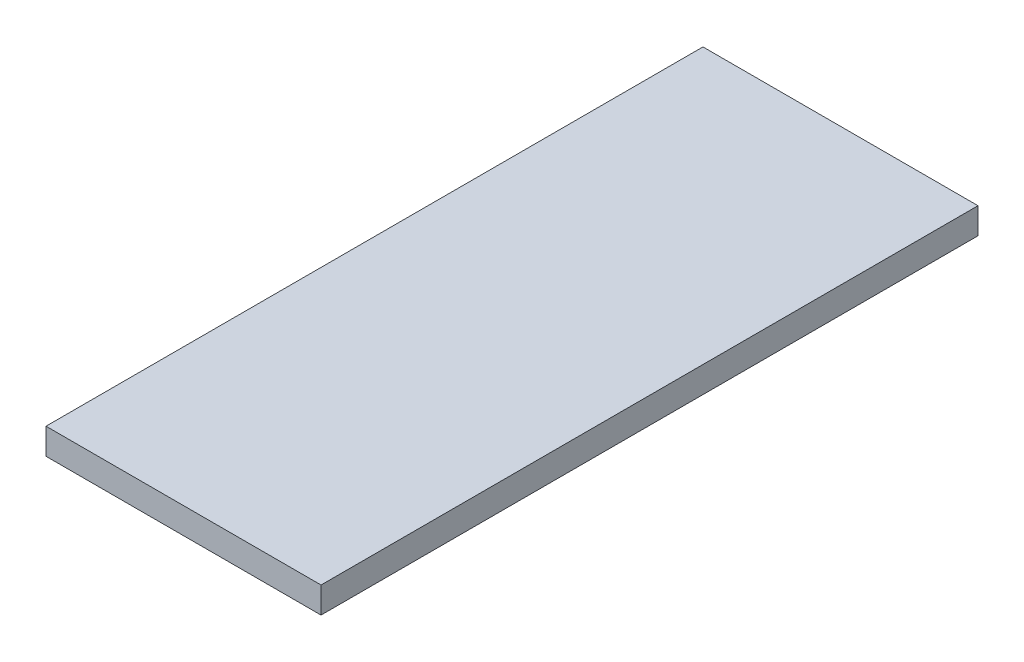
ISO-10303-21;
HEADER;
FILE_DESCRIPTION(('STEP AP214'),'2;1');
FILE_NAME('part.step','',(''),(''),'','','');
FILE_SCHEMA(('AUTOMOTIVE_DESIGN { 1 0 10303 214 1 1 1 1 }'));
ENDSEC;
DATA;
#1=APPLICATION_CONTEXT('core data for automotive mechanical design processes');
#2=APPLICATION_PROTOCOL_DEFINITION('international standard','automotive_design',2000,#1);
#3=PRODUCT_CONTEXT('',#1,'mechanical');
#4=PRODUCT('Part','Part','',(#3));
#5=PRODUCT_RELATED_PRODUCT_CATEGORY('part','',(#4));
#6=PRODUCT_DEFINITION_FORMATION('','',#4);
#7=PRODUCT_DEFINITION_CONTEXT('part definition',#1,'design');
#8=PRODUCT_DEFINITION('design','',#6,#7);
#9=PRODUCT_DEFINITION_SHAPE('','',#8);
#10=(LENGTH_UNIT() NAMED_UNIT(*) SI_UNIT(.MILLI.,.METRE.));
#11=(NAMED_UNIT(*) PLANE_ANGLE_UNIT() SI_UNIT($,.RADIAN.));
#12=(NAMED_UNIT(*) SI_UNIT($,.STERADIAN.) SOLID_ANGLE_UNIT());
#13=UNCERTAINTY_MEASURE_WITH_UNIT(LENGTH_MEASURE(1.E-05),#10,'distance_accuracy_value','');
#14=(GEOMETRIC_REPRESENTATION_CONTEXT(3) GLOBAL_UNCERTAINTY_ASSIGNED_CONTEXT((#13)) GLOBAL_UNIT_ASSIGNED_CONTEXT((#10,
#11,#12)) REPRESENTATION_CONTEXT('',''));
#15=CARTESIAN_POINT('',(0.,0.,0.));
#16=DIRECTION('',(0.,0.,1.));
#17=DIRECTION('',(1.,0.,0.));
#18=AXIS2_PLACEMENT_3D('',#15,#16,#17);
#19=CARTESIAN_POINT('',(0.,4.7625,0.));
#20=DIRECTION('',(1.,0.,0.));
#21=DIRECTION('',(0.,0.,-1.));
#22=AXIS2_PLACEMENT_3D('',#19,#20,#21);
#23=PLANE('',#22);
#24=DIRECTION('',(0.,0.,1.));
#25=VECTOR('',#24,1.);
#26=CARTESIAN_POINT('',(0.,0.,0.));
#27=LINE('',#26,#25);
#28=CARTESIAN_POINT('',(0.,0.,-120.));
#29=VERTEX_POINT('',#28);
#30=CARTESIAN_POINT('',(0.,0.,0.));
#31=VERTEX_POINT('',#30);
#32=EDGE_CURVE('E95',#29,#31,#27,.T.);
#33=ORIENTED_EDGE('',*,*,#32,.T.);
#34=DIRECTION('',(0.,-1.,0.));
#35=VECTOR('',#34,1.);
#36=CARTESIAN_POINT('',(0.,4.7625,0.));
#37=LINE('',#36,#35);
#38=CARTESIAN_POINT('',(0.,4.7625,0.));
#39=VERTEX_POINT('',#38);
#40=EDGE_CURVE('E11',#39,#31,#37,.T.);
#41=ORIENTED_EDGE('',*,*,#40,.F.);
#42=DIRECTION('',(0.,0.,1.));
#43=VECTOR('',#42,1.);
#44=CARTESIAN_POINT('',(0.,4.7625,0.));
#45=LINE('',#44,#43);
#46=CARTESIAN_POINT('',(0.,4.7625,-120.));
#47=VERTEX_POINT('',#46);
#48=EDGE_CURVE('E83',#47,#39,#45,.T.);
#49=ORIENTED_EDGE('',*,*,#48,.F.);
#50=DIRECTION('',(0.,-1.,0.));
#51=VECTOR('',#50,1.);
#52=CARTESIAN_POINT('',(0.,4.7625,-120.));
#53=LINE('',#52,#51);
#54=EDGE_CURVE('E91',#47,#29,#53,.T.);
#55=ORIENTED_EDGE('',*,*,#54,.T.);
#56=EDGE_LOOP('',(#33,#41,#49,#55));
#57=FACE_BOUND('',#56,.T.);
#58=ADVANCED_FACE('F32',(#57),#23,.F.);
#59=CARTESIAN_POINT('',(0.,4.7625,0.));
#60=DIRECTION('',(0.,0.,-1.));
#61=DIRECTION('',(-1.,0.,0.));
#62=AXIS2_PLACEMENT_3D('',#59,#60,#61);
#63=PLANE('',#62);
#64=DIRECTION('',(1.,0.,0.));
#65=VECTOR('',#64,1.);
#66=CARTESIAN_POINT('',(0.,0.,0.));
#67=LINE('',#66,#65);
#68=CARTESIAN_POINT('',(50.24,0.,0.));
#69=VERTEX_POINT('',#68);
#70=EDGE_CURVE('E87',#31,#69,#67,.T.);
#71=ORIENTED_EDGE('',*,*,#70,.T.);
#72=DIRECTION('',(0.,-1.,0.));
#73=VECTOR('',#72,1.);
#74=CARTESIAN_POINT('',(50.24,4.7625,0.));
#75=LINE('',#74,#73);
#76=CARTESIAN_POINT('',(50.24,4.7625,0.));
#77=VERTEX_POINT('',#76);
#78=EDGE_CURVE('E40',#77,#69,#75,.T.);
#79=ORIENTED_EDGE('',*,*,#78,.F.);
#80=DIRECTION('',(1.,0.,0.));
#81=VECTOR('',#80,1.);
#82=CARTESIAN_POINT('',(0.,4.7625,0.));
#83=LINE('',#82,#81);
#84=EDGE_CURVE('E78',#39,#77,#83,.T.);
#85=ORIENTED_EDGE('',*,*,#84,.F.);
#86=ORIENTED_EDGE('',*,*,#40,.T.);
#87=EDGE_LOOP('',(#71,#79,#85,#86));
#88=FACE_BOUND('',#87,.T.);
#89=ADVANCED_FACE('F86',(#88),#63,.F.);
#90=CARTESIAN_POINT('',(50.24,4.7625,0.));
#91=DIRECTION('',(-1.,0.,0.));
#92=DIRECTION('',(0.,0.,1.));
#93=AXIS2_PLACEMENT_3D('',#90,#91,#92);
#94=PLANE('',#93);
#95=DIRECTION('',(0.,0.,-1.));
#96=VECTOR('',#95,1.);
#97=CARTESIAN_POINT('',(50.24,0.,0.));
#98=LINE('',#97,#96);
#99=CARTESIAN_POINT('',(50.24,0.,-120.));
#100=VERTEX_POINT('',#99);
#101=EDGE_CURVE('E65',#69,#100,#98,.T.);
#102=ORIENTED_EDGE('',*,*,#101,.T.);
#103=DIRECTION('',(0.,-1.,0.));
#104=VECTOR('',#103,1.);
#105=CARTESIAN_POINT('',(50.24,4.7625,-120.));
#106=LINE('',#105,#104);
#107=CARTESIAN_POINT('',(50.24,4.7625,-120.));
#108=VERTEX_POINT('',#107);
#109=EDGE_CURVE('E88',#108,#100,#106,.T.);
#110=ORIENTED_EDGE('',*,*,#109,.F.);
#111=DIRECTION('',(0.,0.,-1.));
#112=VECTOR('',#111,1.);
#113=CARTESIAN_POINT('',(50.24,4.7625,0.));
#114=LINE('',#113,#112);
#115=EDGE_CURVE('E81',#77,#108,#114,.T.);
#116=ORIENTED_EDGE('',*,*,#115,.F.);
#117=ORIENTED_EDGE('',*,*,#78,.T.);
#118=EDGE_LOOP('',(#102,#110,#116,#117));
#119=FACE_BOUND('',#118,.T.);
#120=ADVANCED_FACE('F89',(#119),#94,.F.);
#121=CARTESIAN_POINT('',(0.,4.7625,-120.));
#122=DIRECTION('',(0.,0.,1.));
#123=DIRECTION('',(1.,0.,0.));
#124=AXIS2_PLACEMENT_3D('',#121,#122,#123);
#125=PLANE('',#124);
#126=DIRECTION('',(-1.,0.,0.));
#127=VECTOR('',#126,1.);
#128=CARTESIAN_POINT('',(0.,0.,-120.));
#129=LINE('',#128,#127);
#130=EDGE_CURVE('E71',#100,#29,#129,.T.);
#131=ORIENTED_EDGE('',*,*,#130,.T.);
#132=ORIENTED_EDGE('',*,*,#54,.F.);
#133=DIRECTION('',(-1.,0.,0.));
#134=VECTOR('',#133,1.);
#135=CARTESIAN_POINT('',(0.,4.7625,-120.));
#136=LINE('',#135,#134);
#137=EDGE_CURVE('E48',#108,#47,#136,.T.);
#138=ORIENTED_EDGE('',*,*,#137,.F.);
#139=ORIENTED_EDGE('',*,*,#109,.T.);
#140=EDGE_LOOP('',(#131,#132,#138,#139));
#141=FACE_BOUND('',#140,.T.);
#142=ADVANCED_FACE('F102',(#141),#125,.F.);
#143=CARTESIAN_POINT('',(0.,4.7625,0.));
#144=DIRECTION('',(0.,-1.,0.));
#145=DIRECTION('',(0.,0.,-1.));
#146=AXIS2_PLACEMENT_3D('',#143,#144,#145);
#147=PLANE('',#146);
#148=ORIENTED_EDGE('',*,*,#48,.T.);
#149=ORIENTED_EDGE('',*,*,#84,.T.);
#150=ORIENTED_EDGE('',*,*,#115,.T.);
#151=ORIENTED_EDGE('',*,*,#137,.T.);
#152=EDGE_LOOP('',(#148,#149,#150,#151));
#153=FACE_BOUND('',#152,.T.);
#154=ADVANCED_FACE('F79',(#153),#147,.F.);
#155=CARTESIAN_POINT('',(0.,0.,0.));
#156=DIRECTION('',(0.,-1.,0.));
#157=DIRECTION('',(0.,0.,-1.));
#158=AXIS2_PLACEMENT_3D('',#155,#156,#157);
#159=PLANE('',#158);
#160=ORIENTED_EDGE('',*,*,#32,.F.);
#161=ORIENTED_EDGE('',*,*,#130,.F.);
#162=ORIENTED_EDGE('',*,*,#101,.F.);
#163=ORIENTED_EDGE('',*,*,#70,.F.);
#164=EDGE_LOOP('',(#160,#161,#162,#163));
#165=FACE_BOUND('',#164,.T.);
#166=ADVANCED_FACE('F105',(#165),#159,.T.);
#167=CLOSED_SHELL('',(#58,#89,#120,#142,#154,#166));
#168=MANIFOLD_SOLID_BREP('B2',#167);
#169=ADVANCED_BREP_SHAPE_REPRESENTATION('',(#18,#168),#14);
#170=SHAPE_DEFINITION_REPRESENTATION(#9,#169);
ENDSEC;
END-ISO-10303-21;
